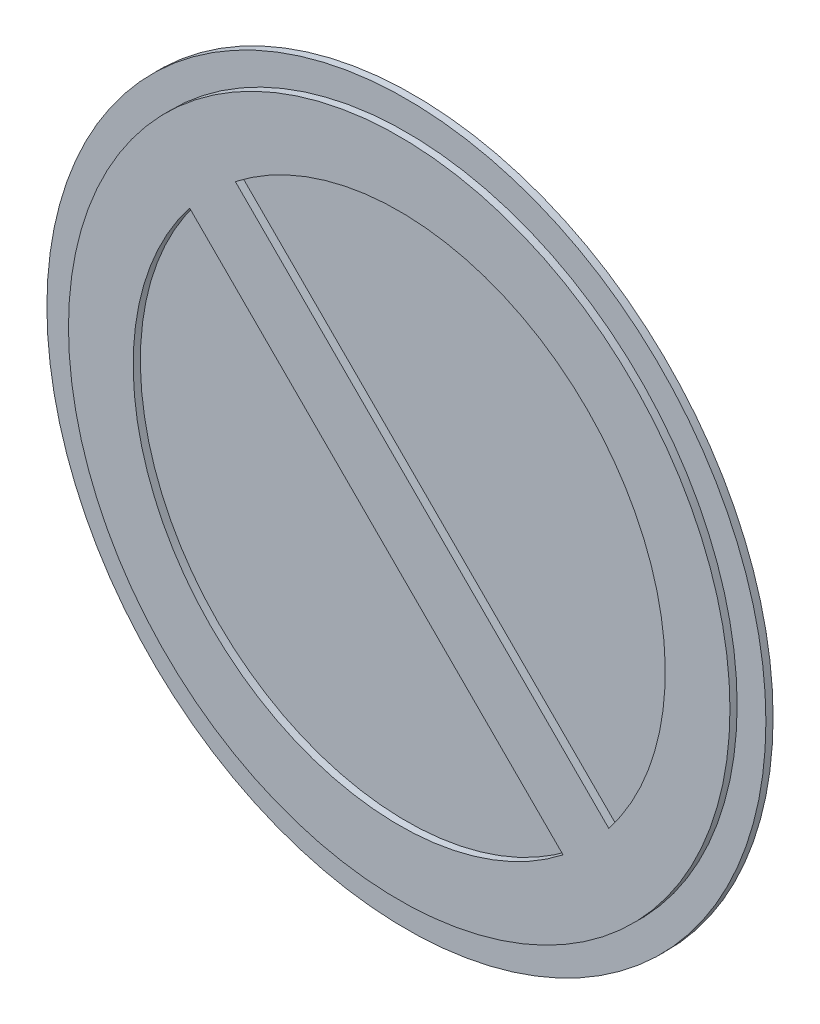
ISO-10303-21;
HEADER;
FILE_DESCRIPTION(('STEP AP214'),'2;1');
FILE_NAME('part.step','',(''),(''),'','','');
FILE_SCHEMA(('AUTOMOTIVE_DESIGN { 1 0 10303 214 1 1 1 1 }'));
ENDSEC;
DATA;
#1=APPLICATION_CONTEXT('core data for automotive mechanical design processes');
#2=APPLICATION_PROTOCOL_DEFINITION('international standard','automotive_design',2000,#1);
#3=PRODUCT_CONTEXT('',#1,'mechanical');
#4=PRODUCT('Part','Part','',(#3));
#5=PRODUCT_RELATED_PRODUCT_CATEGORY('part','',(#4));
#6=PRODUCT_DEFINITION_FORMATION('','',#4);
#7=PRODUCT_DEFINITION_CONTEXT('part definition',#1,'design');
#8=PRODUCT_DEFINITION('design','',#6,#7);
#9=PRODUCT_DEFINITION_SHAPE('','',#8);
#10=(LENGTH_UNIT() NAMED_UNIT(*) SI_UNIT(.MILLI.,.METRE.));
#11=(NAMED_UNIT(*) PLANE_ANGLE_UNIT() SI_UNIT($,.RADIAN.));
#12=(NAMED_UNIT(*) SI_UNIT($,.STERADIAN.) SOLID_ANGLE_UNIT());
#13=UNCERTAINTY_MEASURE_WITH_UNIT(LENGTH_MEASURE(1.E-05),#10,'distance_accuracy_value','');
#14=(GEOMETRIC_REPRESENTATION_CONTEXT(3) GLOBAL_UNCERTAINTY_ASSIGNED_CONTEXT((#13)) GLOBAL_UNIT_ASSIGNED_CONTEXT((#10,
#11,#12)) REPRESENTATION_CONTEXT('',''));
#15=CARTESIAN_POINT('',(0.,0.,0.));
#16=DIRECTION('',(0.,0.,1.));
#17=DIRECTION('',(1.,0.,0.));
#18=AXIS2_PLACEMENT_3D('',#15,#16,#17);
#19=CARTESIAN_POINT('',(0.,0.,0.5));
#20=DIRECTION('',(0.,0.,1.));
#21=DIRECTION('',(1.,0.,0.));
#22=AXIS2_PLACEMENT_3D('',#19,#20,#21);
#23=PLANE('',#22);
#24=CARTESIAN_POINT('',(0.,0.,0.5));
#25=DIRECTION('',(0.,0.,-1.));
#26=DIRECTION('',(-1.,0.,0.));
#27=AXIS2_PLACEMENT_3D('',#24,#25,#26);
#28=CIRCLE('',#27,18.5);
#29=CARTESIAN_POINT('',(-14.5753558563426,11.3933753410031,0.5));
#30=VERTEX_POINT('',#29);
#31=CARTESIAN_POINT('',(11.3933753410032,-14.5753558563426,0.5));
#32=VERTEX_POINT('',#31);
#33=EDGE_CURVE('E20',#30,#32,#28,.F.);
#34=ORIENTED_EDGE('',*,*,#33,.T.);
#35=DIRECTION('',(0.707106781186549,-0.707106781186546,0.));
#36=VECTOR('',#35,1.);
#37=CARTESIAN_POINT('',(-14.5753558563426,11.3933753410031,0.5));
#38=LINE('',#37,#36);
#39=EDGE_CURVE('E55',#30,#32,#38,.T.);
#40=ORIENTED_EDGE('',*,*,#39,.F.);
#41=EDGE_LOOP('',(#34,#40));
#42=FACE_BOUND('',#41,.T.);
#43=ADVANCED_FACE('F17',(#42),#23,.T.);
#44=CARTESIAN_POINT('',(0.,0.,0.5));
#45=DIRECTION('',(0.,0.,1.));
#46=DIRECTION('',(1.,0.,0.));
#47=AXIS2_PLACEMENT_3D('',#44,#45,#46);
#48=PLANE('',#47);
#49=CARTESIAN_POINT('',(0.,0.,0.5));
#50=DIRECTION('',(0.,0.,-1.));
#51=DIRECTION('',(-1.,0.,0.));
#52=AXIS2_PLACEMENT_3D('',#49,#50,#51);
#53=CIRCLE('',#52,18.5);
#54=CARTESIAN_POINT('',(14.5753558563426,-11.3933753410031,0.5));
#55=VERTEX_POINT('',#54);
#56=CARTESIAN_POINT('',(-11.3933753410032,14.5753558563426,0.5));
#57=VERTEX_POINT('',#56);
#58=EDGE_CURVE('E76',#55,#57,#53,.F.);
#59=ORIENTED_EDGE('',*,*,#58,.T.);
#60=DIRECTION('',(-0.707106781186549,0.707106781186546,0.));
#61=VECTOR('',#60,1.);
#62=CARTESIAN_POINT('',(-11.3933753410032,14.5753558563426,0.5));
#63=LINE('',#62,#61);
#64=EDGE_CURVE('E60',#55,#57,#63,.T.);
#65=ORIENTED_EDGE('',*,*,#64,.F.);
#66=EDGE_LOOP('',(#59,#65));
#67=FACE_BOUND('',#66,.T.);
#68=ADVANCED_FACE('F196',(#67),#48,.T.);
#69=CARTESIAN_POINT('',(-14.5753558563426,11.3933753410031,1.));
#70=DIRECTION('',(-0.707106781186546,-0.707106781186549,0.));
#71=DIRECTION('',(0.707106781186549,-0.707106781186546,0.));
#72=AXIS2_PLACEMENT_3D('',#69,#70,#71);
#73=PLANE('',#72);
#74=ORIENTED_EDGE('',*,*,#39,.T.);
#75=DIRECTION('',(0.,0.,-1.));
#76=VECTOR('',#75,1.);
#77=CARTESIAN_POINT('',(11.3933753410032,-14.5753558563426,1.));
#78=LINE('',#77,#76);
#79=CARTESIAN_POINT('',(11.3933753410032,-14.5753558563426,1.));
#80=VERTEX_POINT('',#79);
#81=EDGE_CURVE('E66',#32,#80,#78,.F.);
#82=ORIENTED_EDGE('',*,*,#81,.T.);
#83=DIRECTION('',(0.707106781186549,-0.707106781186546,0.));
#84=VECTOR('',#83,1.);
#85=CARTESIAN_POINT('',(-14.5753558563426,11.3933753410031,1.));
#86=LINE('',#85,#84);
#87=CARTESIAN_POINT('',(-14.5753558563426,11.3933753410031,1.));
#88=VERTEX_POINT('',#87);
#89=EDGE_CURVE('E88',#88,#80,#86,.T.);
#90=ORIENTED_EDGE('',*,*,#89,.F.);
#91=DIRECTION('',(0.,0.,-1.));
#92=VECTOR('',#91,1.);
#93=CARTESIAN_POINT('',(-14.5753558563426,11.3933753410031,1.));
#94=LINE('',#93,#92);
#95=EDGE_CURVE('E61',#88,#30,#94,.T.);
#96=ORIENTED_EDGE('',*,*,#95,.T.);
#97=EDGE_LOOP('',(#74,#82,#90,#96));
#98=FACE_BOUND('',#97,.T.);
#99=ADVANCED_FACE('F64',(#98),#73,.T.);
#100=CARTESIAN_POINT('',(0.,0.,1.));
#101=DIRECTION('',(0.,0.,-1.));
#102=DIRECTION('',(-1.,0.,0.));
#103=AXIS2_PLACEMENT_3D('',#100,#101,#102);
#104=CYLINDRICAL_SURFACE('',#103,18.5);
#105=CARTESIAN_POINT('',(0.,0.,1.));
#106=DIRECTION('',(0.,0.,-1.));
#107=DIRECTION('',(-1.,0.,0.));
#108=AXIS2_PLACEMENT_3D('',#105,#106,#107);
#109=CIRCLE('',#108,18.5);
#110=EDGE_CURVE('E70',#80,#88,#109,.T.);
#111=ORIENTED_EDGE('',*,*,#110,.F.);
#112=ORIENTED_EDGE('',*,*,#81,.F.);
#113=ORIENTED_EDGE('',*,*,#33,.F.);
#114=ORIENTED_EDGE('',*,*,#95,.F.);
#115=EDGE_LOOP('',(#111,#112,#113,#114));
#116=FACE_BOUND('',#115,.T.);
#117=ADVANCED_FACE('F68',(#116),#104,.F.);
#118=CARTESIAN_POINT('',(-11.3933753410032,14.5753558563426,1.));
#119=DIRECTION('',(0.707106781186546,0.707106781186549,0.));
#120=DIRECTION('',(-0.707106781186549,0.707106781186546,0.));
#121=AXIS2_PLACEMENT_3D('',#118,#119,#120);
#122=PLANE('',#121);
#123=ORIENTED_EDGE('',*,*,#64,.T.);
#124=DIRECTION('',(0.,0.,-1.));
#125=VECTOR('',#124,1.);
#126=CARTESIAN_POINT('',(-11.3933753410032,14.5753558563426,1.));
#127=LINE('',#126,#125);
#128=CARTESIAN_POINT('',(-11.3933753410032,14.5753558563426,1.));
#129=VERTEX_POINT('',#128);
#130=EDGE_CURVE('E90',#57,#129,#127,.F.);
#131=ORIENTED_EDGE('',*,*,#130,.T.);
#132=DIRECTION('',(-0.707106781186549,0.707106781186546,0.));
#133=VECTOR('',#132,1.);
#134=CARTESIAN_POINT('',(14.5753558563426,-11.3933753410031,1.));
#135=LINE('',#134,#133);
#136=CARTESIAN_POINT('',(14.5753558563426,-11.3933753410031,1.));
#137=VERTEX_POINT('',#136);
#138=EDGE_CURVE('E34',#137,#129,#135,.T.);
#139=ORIENTED_EDGE('',*,*,#138,.F.);
#140=DIRECTION('',(0.,0.,-1.));
#141=VECTOR('',#140,1.);
#142=CARTESIAN_POINT('',(14.5753558563426,-11.3933753410031,1.));
#143=LINE('',#142,#141);
#144=EDGE_CURVE('E93',#137,#55,#143,.T.);
#145=ORIENTED_EDGE('',*,*,#144,.T.);
#146=EDGE_LOOP('',(#123,#131,#139,#145));
#147=FACE_BOUND('',#146,.T.);
#148=ADVANCED_FACE('F116',(#147),#122,.T.);
#149=CARTESIAN_POINT('',(0.,0.,1.));
#150=DIRECTION('',(0.,0.,-1.));
#151=DIRECTION('',(-1.,0.,0.));
#152=AXIS2_PLACEMENT_3D('',#149,#150,#151);
#153=CYLINDRICAL_SURFACE('',#152,18.5);
#154=CARTESIAN_POINT('',(0.,0.,1.));
#155=DIRECTION('',(0.,0.,-1.));
#156=DIRECTION('',(-1.,0.,0.));
#157=AXIS2_PLACEMENT_3D('',#154,#155,#156);
#158=CIRCLE('',#157,18.5);
#159=EDGE_CURVE('E86',#129,#137,#158,.T.);
#160=ORIENTED_EDGE('',*,*,#159,.F.);
#161=ORIENTED_EDGE('',*,*,#130,.F.);
#162=ORIENTED_EDGE('',*,*,#58,.F.);
#163=ORIENTED_EDGE('',*,*,#144,.F.);
#164=EDGE_LOOP('',(#160,#161,#162,#163));
#165=FACE_BOUND('',#164,.T.);
#166=ADVANCED_FACE('F105',(#165),#153,.F.);
#167=CARTESIAN_POINT('',(0.,0.,1.));
#168=DIRECTION('',(0.,0.,1.));
#169=DIRECTION('',(1.,0.,0.));
#170=AXIS2_PLACEMENT_3D('',#167,#168,#169);
#171=PLANE('',#170);
#172=ORIENTED_EDGE('',*,*,#138,.T.);
#173=ORIENTED_EDGE('',*,*,#159,.T.);
#174=EDGE_LOOP('',(#172,#173));
#175=FACE_BOUND('',#174,.T.);
#176=CARTESIAN_POINT('',(0.,0.,1.));
#177=DIRECTION('',(0.,0.,-1.));
#178=DIRECTION('',(-1.,0.,0.));
#179=AXIS2_PLACEMENT_3D('',#176,#177,#178);
#180=CIRCLE('',#179,23.);
#181=CARTESIAN_POINT('',(-23.,0.,1.));
#182=VERTEX_POINT('',#181);
#183=EDGE_CURVE('E83',#182,#182,#180,.T.);
#184=ORIENTED_EDGE('',*,*,#183,.F.);
#185=EDGE_LOOP('',(#184));
#186=FACE_BOUND('',#185,.T.);
#187=ORIENTED_EDGE('',*,*,#89,.T.);
#188=ORIENTED_EDGE('',*,*,#110,.T.);
#189=EDGE_LOOP('',(#187,#188));
#190=FACE_BOUND('',#189,.T.);
#191=ADVANCED_FACE('F102',(#175,#186,#190),#171,.T.);
#192=CARTESIAN_POINT('',(0.,0.,1.));
#193=DIRECTION('',(0.,0.,-1.));
#194=DIRECTION('',(-1.,0.,0.));
#195=AXIS2_PLACEMENT_3D('',#192,#193,#194);
#196=CYLINDRICAL_SURFACE('',#195,23.);
#197=ORIENTED_EDGE('',*,*,#183,.T.);
#198=EDGE_LOOP('',(#197));
#199=FACE_BOUND('',#198,.T.);
#200=CARTESIAN_POINT('',(0.,0.,0.5));
#201=DIRECTION('',(0.,0.,-1.));
#202=DIRECTION('',(-1.,0.,0.));
#203=AXIS2_PLACEMENT_3D('',#200,#201,#202);
#204=CIRCLE('',#203,23.);
#205=CARTESIAN_POINT('',(-23.,0.,0.5));
#206=VERTEX_POINT('',#205);
#207=EDGE_CURVE('E80',#206,#206,#204,.T.);
#208=ORIENTED_EDGE('',*,*,#207,.F.);
#209=EDGE_LOOP('',(#208));
#210=FACE_BOUND('',#209,.T.);
#211=ADVANCED_FACE('F104',(#199,#210),#196,.T.);
#212=CARTESIAN_POINT('',(0.,0.,0.5));
#213=DIRECTION('',(0.,0.,1.));
#214=DIRECTION('',(1.,0.,0.));
#215=AXIS2_PLACEMENT_3D('',#212,#213,#214);
#216=PLANE('',#215);
#217=CARTESIAN_POINT('',(0.,0.,0.5));
#218=DIRECTION('',(0.,0.,-1.));
#219=DIRECTION('',(-1.,0.,0.));
#220=AXIS2_PLACEMENT_3D('',#217,#218,#219);
#221=CIRCLE('',#220,25.);
#222=CARTESIAN_POINT('',(-25.,0.,0.5));
#223=VERTEX_POINT('',#222);
#224=EDGE_CURVE('E26',#223,#223,#221,.T.);
#225=ORIENTED_EDGE('',*,*,#224,.F.);
#226=EDGE_LOOP('',(#225));
#227=FACE_BOUND('',#226,.T.);
#228=ORIENTED_EDGE('',*,*,#207,.T.);
#229=EDGE_LOOP('',(#228));
#230=FACE_BOUND('',#229,.T.);
#231=ADVANCED_FACE('F113',(#227,#230),#216,.T.);
#232=CARTESIAN_POINT('',(0.,0.,0.5));
#233=DIRECTION('',(0.,0.,-1.));
#234=DIRECTION('',(-1.,0.,0.));
#235=AXIS2_PLACEMENT_3D('',#232,#233,#234);
#236=CYLINDRICAL_SURFACE('',#235,25.);
#237=ORIENTED_EDGE('',*,*,#224,.T.);
#238=EDGE_LOOP('',(#237));
#239=FACE_BOUND('',#238,.T.);
#240=CARTESIAN_POINT('',(0.,0.,0.));
#241=DIRECTION('',(0.,0.,-1.));
#242=DIRECTION('',(-1.,0.,0.));
#243=AXIS2_PLACEMENT_3D('',#240,#241,#242);
#244=CIRCLE('',#243,25.);
#245=CARTESIAN_POINT('',(-25.,0.,0.));
#246=VERTEX_POINT('',#245);
#247=EDGE_CURVE('E11',#246,#246,#244,.F.);
#248=ORIENTED_EDGE('',*,*,#247,.T.);
#249=EDGE_LOOP('',(#248));
#250=FACE_BOUND('',#249,.T.);
#251=ADVANCED_FACE('F122',(#239,#250),#236,.T.);
#252=CARTESIAN_POINT('',(0.,0.,0.));
#253=DIRECTION('',(0.,0.,1.));
#254=DIRECTION('',(1.,0.,0.));
#255=AXIS2_PLACEMENT_3D('',#252,#253,#254);
#256=PLANE('',#255);
#257=ORIENTED_EDGE('',*,*,#247,.F.);
#258=EDGE_LOOP('',(#257));
#259=FACE_BOUND('',#258,.T.);
#260=ADVANCED_FACE('F120',(#259),#256,.F.);
#261=CLOSED_SHELL('',(#43,#68,#99,#117,#148,#166,#191,#211,#231,#251,#260));
#262=MANIFOLD_SOLID_BREP('B1',#261);
#263=ADVANCED_BREP_SHAPE_REPRESENTATION('',(#18,#262),#14);
#264=SHAPE_DEFINITION_REPRESENTATION(#9,#263);
ENDSEC;
END-ISO-10303-21;
